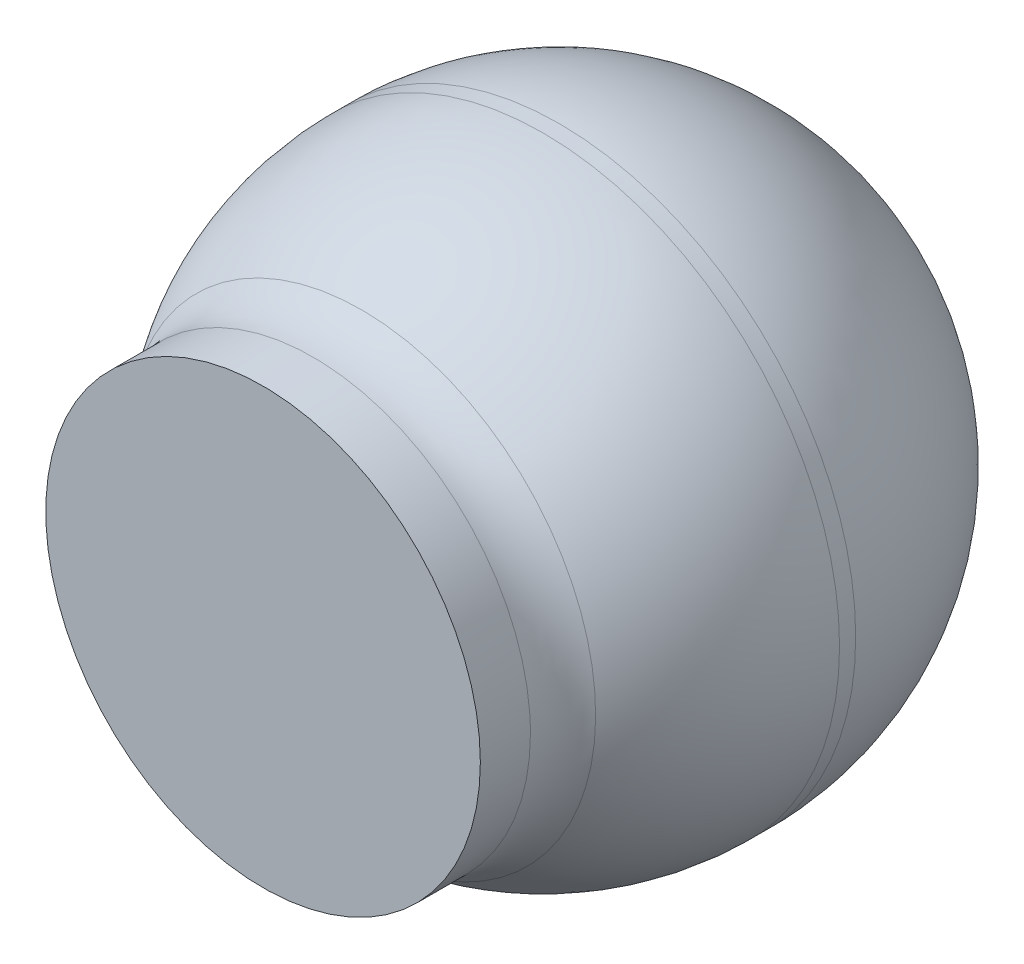
ISO-10303-21;
HEADER;
FILE_DESCRIPTION(('STEP AP214'),'2;1');
FILE_NAME('part.step','',(''),(''),'','','');
FILE_SCHEMA(('AUTOMOTIVE_DESIGN { 1 0 10303 214 1 1 1 1 }'));
ENDSEC;
DATA;
#1=APPLICATION_CONTEXT('core data for automotive mechanical design processes');
#2=APPLICATION_PROTOCOL_DEFINITION('international standard','automotive_design',2000,#1);
#3=PRODUCT_CONTEXT('',#1,'mechanical');
#4=PRODUCT('Part','Part','',(#3));
#5=PRODUCT_RELATED_PRODUCT_CATEGORY('part','',(#4));
#6=PRODUCT_DEFINITION_FORMATION('','',#4);
#7=PRODUCT_DEFINITION_CONTEXT('part definition',#1,'design');
#8=PRODUCT_DEFINITION('design','',#6,#7);
#9=PRODUCT_DEFINITION_SHAPE('','',#8);
#10=(LENGTH_UNIT() NAMED_UNIT(*) SI_UNIT(.MILLI.,.METRE.));
#11=(NAMED_UNIT(*) PLANE_ANGLE_UNIT() SI_UNIT($,.RADIAN.));
#12=(NAMED_UNIT(*) SI_UNIT($,.STERADIAN.) SOLID_ANGLE_UNIT());
#13=UNCERTAINTY_MEASURE_WITH_UNIT(LENGTH_MEASURE(1.E-05),#10,'distance_accuracy_value','');
#14=(GEOMETRIC_REPRESENTATION_CONTEXT(3) GLOBAL_UNCERTAINTY_ASSIGNED_CONTEXT((#13)) GLOBAL_UNIT_ASSIGNED_CONTEXT((#10,
#11,#12)) REPRESENTATION_CONTEXT('',''));
#15=CARTESIAN_POINT('',(0.,0.,0.));
#16=DIRECTION('',(0.,0.,1.));
#17=DIRECTION('',(1.,0.,0.));
#18=AXIS2_PLACEMENT_3D('',#15,#16,#17);
#19=CARTESIAN_POINT('',(0.707080077731,-11.67134929145,10.006534503384));
#20=DIRECTION('',(0.,0.,-1.));
#21=DIRECTION('',(-1.,0.,0.));
#22=AXIS2_PLACEMENT_3D('',#19,#20,#21);
#23=PLANE('',#22);
#24=CARTESIAN_POINT('',(0.707080077731,-11.67134929145,10.006534503384));
#25=DIRECTION('',(0.,0.,1.));
#26=DIRECTION('',(1.,0.,0.));
#27=AXIS2_PLACEMENT_3D('',#24,#25,#26);
#28=CIRCLE('',#27,0.275);
#29=CARTESIAN_POINT('',(0.982080077731,-11.67134929145,10.006534503384));
#30=VERTEX_POINT('',#29);
#31=EDGE_CURVE('E20',#30,#30,#28,.F.);
#32=ORIENTED_EDGE('',*,*,#31,.F.);
#33=EDGE_LOOP('',(#32));
#34=FACE_BOUND('',#33,.T.);
#35=ADVANCED_FACE('F17',(#34),#23,.F.);
#36=CARTESIAN_POINT('',(0.707080077731,-11.67134929145,9.906534503384));
#37=DIRECTION('',(0.,0.,1.));
#38=DIRECTION('',(1.,0.,0.));
#39=AXIS2_PLACEMENT_3D('',#36,#37,#38);
#40=CYLINDRICAL_SURFACE('',#39,0.275);
#41=CARTESIAN_POINT('',(0.707080077731,-11.67134929145,9.943180457728));
#42=DIRECTION('',(0.,0.,-1.));
#43=DIRECTION('',(0.996700902337582,0.081162252799247,0.));
#44=AXIS2_PLACEMENT_3D('',#41,#42,#43);
#45=CIRCLE('',#44,0.275);
#46=CARTESIAN_POINT('',(0.981172825873835,-11.6490296719302,9.943180457728));
#47=VERTEX_POINT('',#46);
#48=EDGE_CURVE('E66',#47,#47,#45,.F.);
#49=ORIENTED_EDGE('',*,*,#48,.T.);
#50=EDGE_LOOP('',(#49));
#51=FACE_BOUND('',#50,.T.);
#52=ORIENTED_EDGE('',*,*,#31,.T.);
#53=EDGE_LOOP('',(#52));
#54=FACE_BOUND('',#53,.T.);
#55=ADVANCED_FACE('F62',(#51,#54),#40,.T.);
#56=CARTESIAN_POINT('',(0.707080077731,-11.67134929145,9.943180457728));
#57=DIRECTION('',(0.,0.,-1.));
#58=DIRECTION('',(0.996700902337583,0.0811622527992449,0.));
#59=AXIS2_PLACEMENT_3D('',#56,#57,#58);
#60=TOROIDAL_SURFACE('',#59,0.375,0.1);
#61=ORIENTED_EDGE('',*,*,#48,.F.);
#62=EDGE_LOOP('',(#61));
#63=FACE_BOUND('',#62,.T.);
#64=CARTESIAN_POINT('',(0.707080077731001,-11.67134929145,9.881744931236));
#65=DIRECTION('',(0.,0.,-1.));
#66=DIRECTION('',(-0.996700902338691,-0.0811622527856353,0.));
#67=AXIS2_PLACEMENT_3D('',#64,#65,#66);
#68=CIRCLE('',#67,0.29609704641234);
#69=CARTESIAN_POINT('',(0.411959884392,-11.69538119478,9.881744931236));
#70=VERTEX_POINT('',#69);
#71=EDGE_CURVE('E39',#70,#70,#68,.T.);
#72=ORIENTED_EDGE('',*,*,#71,.F.);
#73=EDGE_LOOP('',(#72));
#74=FACE_BOUND('',#73,.T.);
#75=ADVANCED_FACE('F57',(#63,#74),#60,.F.);
#76=CARTESIAN_POINT('',(0.333317239355,-11.70178513625,9.651976062157));
#77=CARTESIAN_POINT('',(0.333317239355,-11.70178513625,9.701461392103));
#78=CARTESIAN_POINT('',(0.341473782652,-11.70112094157,9.750947004335));
#79=CARTESIAN_POINT('',(0.357792914651,-11.69979205995,9.798626332798));
#80=CARTESIAN_POINT('',(0.381658609162,-11.69784865493,9.842699544317));
#81=CARTESIAN_POINT('',(0.411959884392,-11.69538119478,9.881744931236));
#82=(BOUNDED_CURVE() B_SPLINE_CURVE(5,(#76,#77,#78,#79,#80,#81),.UNSPECIFIED.,.F.,
.F.) B_SPLINE_CURVE_WITH_KNOTS((6,6),(0.,0.661568582165),
.UNSPECIFIED.) CURVE() GEOMETRIC_REPRESENTATION_ITEM() RATIONAL_B_SPLINE_CURVE((1.,1.,1.,1.,1.,1.)) REPRESENTATION_ITEM(''));
#83=CARTESIAN_POINT('',(0.707080077731,-11.67134929145,9.651976062157));
#84=DIRECTION('',(0.,0.,-1.));
#85=AXIS1_PLACEMENT('',#83,#84);
#86=SURFACE_OF_REVOLUTION('',#82,#85);
#87=CARTESIAN_POINT('',(0.707080077731001,-11.67134929145,9.651976062157));
#88=DIRECTION('',(0.,0.,1.));
#89=DIRECTION('',(1.,0.,0.));
#90=AXIS2_PLACEMENT_3D('',#87,#88,#89);
#91=CIRCLE('',#90,0.375);
#92=CARTESIAN_POINT('',(1.082080077731,-11.67134929145,9.651976062157));
#93=VERTEX_POINT('',#92);
#94=EDGE_CURVE('E36',#93,#93,#91,.F.);
#95=ORIENTED_EDGE('',*,*,#94,.F.);
#96=EDGE_LOOP('',(#95));
#97=FACE_BOUND('',#96,.T.);
#98=ORIENTED_EDGE('',*,*,#71,.T.);
#99=EDGE_LOOP('',(#98));
#100=FACE_BOUND('',#99,.T.);
#101=ADVANCED_FACE('F53',(#97,#100),#86,.F.);
#102=CARTESIAN_POINT('',(0.707080077731,-11.67134929145,9.256534503384));
#103=DIRECTION('',(0.,0.,1.));
#104=DIRECTION('',(1.,0.,0.));
#105=AXIS2_PLACEMENT_3D('',#102,#103,#104);
#106=CYLINDRICAL_SURFACE('',#105,0.375);
#107=CARTESIAN_POINT('',(0.707080077731,-11.67134929145,9.631534503384));
#108=DIRECTION('',(0.,0.,-1.));
#109=DIRECTION('',(0.0811622527992362,-0.996700902337583,0.));
#110=AXIS2_PLACEMENT_3D('',#107,#108,#109);
#111=CIRCLE('',#110,0.375);
#112=CARTESIAN_POINT('',(0.737515922530713,-12.0451121298266,9.631534503384));
#113=VERTEX_POINT('',#112);
#114=CARTESIAN_POINT('',(0.676644232931287,-11.2975864530734,9.631534503384));
#115=VERTEX_POINT('',#114);
#116=EDGE_CURVE('E11',#113,#115,#111,.T.);
#117=ORIENTED_EDGE('',*,*,#116,.F.);
#118=CARTESIAN_POINT('',(0.707080077731,-11.67134929145,9.631534503384));
#119=DIRECTION('',(3.33436315446763E-12,2.72100352061447E-13,1.));
#120=DIRECTION('',(0.0811622527992359,-0.996700902337583,0.));
#121=AXIS2_PLACEMENT_3D('',#118,#119,#120);
#122=CIRCLE('',#121,0.375);
#123=EDGE_CURVE('E25',#115,#113,#122,.F.);
#124=ORIENTED_EDGE('',*,*,#123,.F.);
#125=EDGE_LOOP('',(#117,#124));
#126=FACE_BOUND('',#125,.T.);
#127=ORIENTED_EDGE('',*,*,#94,.T.);
#128=EDGE_LOOP('',(#127));
#129=FACE_BOUND('',#128,.T.);
#130=ADVANCED_FACE('F34',(#126,#129),#106,.T.);
#131=CARTESIAN_POINT('',(0.707080077731,-11.67134929145,9.631534503384));
#132=DIRECTION('',(0.0811622527992361,-0.996700902337583,0.));
#133=DIRECTION('',(-0.996700902337583,-0.0811622527992361,0.));
#134=AXIS2_PLACEMENT_3D('',#131,#132,#133);
#135=SPHERICAL_SURFACE('',#134,0.375);
#136=ORIENTED_EDGE('',*,*,#123,.T.);
#137=ORIENTED_EDGE('',*,*,#116,.T.);
#138=EDGE_LOOP('',(#136,#137));
#139=FACE_BOUND('',#138,.T.);
#140=ADVANCED_FACE('F32',(#139),#135,.T.);
#141=CLOSED_SHELL('',(#35,#55,#75,#101,#130,#140));
#142=MANIFOLD_SOLID_BREP('B1',#141);
#143=ADVANCED_BREP_SHAPE_REPRESENTATION('',(#18,#142),#14);
#144=SHAPE_DEFINITION_REPRESENTATION(#9,#143);
ENDSEC;
END-ISO-10303-21;
